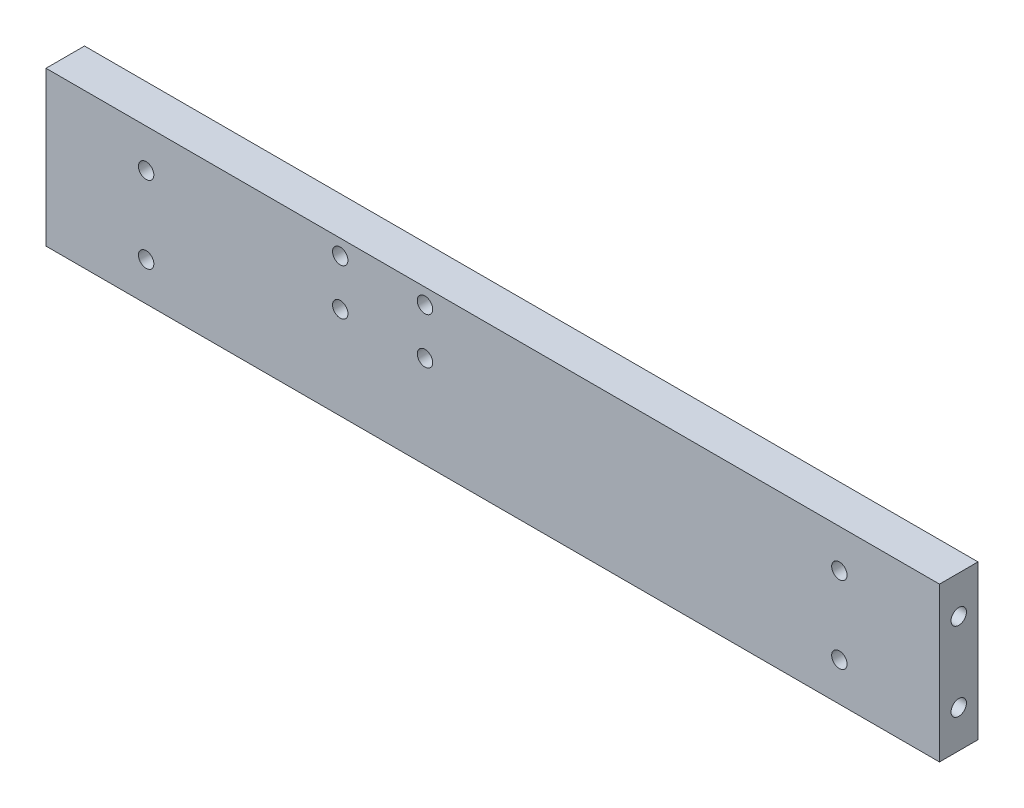
ISO-10303-21;
HEADER;
FILE_DESCRIPTION(('STEP AP214'),'2;1');
FILE_NAME('part.step','',(''),(''),'','','');
FILE_SCHEMA(('AUTOMOTIVE_DESIGN { 1 0 10303 214 1 1 1 1 }'));
ENDSEC;
DATA;
#1=APPLICATION_CONTEXT('core data for automotive mechanical design processes');
#2=APPLICATION_PROTOCOL_DEFINITION('international standard','automotive_design',2000,#1);
#3=PRODUCT_CONTEXT('',#1,'mechanical');
#4=PRODUCT('Part','Part','',(#3));
#5=PRODUCT_RELATED_PRODUCT_CATEGORY('part','',(#4));
#6=PRODUCT_DEFINITION_FORMATION('','',#4);
#7=PRODUCT_DEFINITION_CONTEXT('part definition',#1,'design');
#8=PRODUCT_DEFINITION('design','',#6,#7);
#9=PRODUCT_DEFINITION_SHAPE('','',#8);
#10=(LENGTH_UNIT() NAMED_UNIT(*) SI_UNIT(.MILLI.,.METRE.));
#11=(NAMED_UNIT(*) PLANE_ANGLE_UNIT() SI_UNIT($,.RADIAN.));
#12=(NAMED_UNIT(*) SI_UNIT($,.STERADIAN.) SOLID_ANGLE_UNIT());
#13=UNCERTAINTY_MEASURE_WITH_UNIT(LENGTH_MEASURE(1.E-05),#10,'distance_accuracy_value','');
#14=(GEOMETRIC_REPRESENTATION_CONTEXT(3) GLOBAL_UNCERTAINTY_ASSIGNED_CONTEXT((#13)) GLOBAL_UNIT_ASSIGNED_CONTEXT((#10,
#11,#12)) REPRESENTATION_CONTEXT('',''));
#15=CARTESIAN_POINT('',(0.,0.,0.));
#16=DIRECTION('',(0.,0.,1.));
#17=DIRECTION('',(1.,0.,0.));
#18=AXIS2_PLACEMENT_3D('',#15,#16,#17);
#19=CARTESIAN_POINT('',(0.,0.,5.));
#20=DIRECTION('',(0.,0.,1.));
#21=DIRECTION('',(1.,0.,0.));
#22=AXIS2_PLACEMENT_3D('',#19,#20,#21);
#23=PLANE('',#22);
#24=CARTESIAN_POINT('',(-19.8,2.,5.));
#25=DIRECTION('',(0.,0.,-1.));
#26=DIRECTION('',(-1.,0.,0.));
#27=AXIS2_PLACEMENT_3D('',#24,#25,#26);
#28=CIRCLE('',#27,1.);
#29=CARTESIAN_POINT('',(-20.8,2.,5.));
#30=VERTEX_POINT('',#29);
#31=EDGE_CURVE('E190',#30,#30,#28,.F.);
#32=ORIENTED_EDGE('',*,*,#31,.F.);
#33=EDGE_LOOP('',(#32));
#34=FACE_BOUND('',#33,.T.);
#35=CARTESIAN_POINT('',(-8.8,8.,5.));
#36=DIRECTION('',(0.,0.,-1.));
#37=DIRECTION('',(-1.,0.,0.));
#38=AXIS2_PLACEMENT_3D('',#35,#36,#37);
#39=CIRCLE('',#38,1.);
#40=CARTESIAN_POINT('',(-9.8,8.,5.));
#41=VERTEX_POINT('',#40);
#42=EDGE_CURVE('E161',#41,#41,#39,.F.);
#43=ORIENTED_EDGE('',*,*,#42,.F.);
#44=EDGE_LOOP('',(#43));
#45=FACE_BOUND('',#44,.T.);
#46=CARTESIAN_POINT('',(45.,-5.,5.));
#47=DIRECTION('',(0.,0.,1.));
#48=DIRECTION('',(1.,0.,0.));
#49=AXIS2_PLACEMENT_3D('',#46,#47,#48);
#50=CIRCLE('',#49,0.999999999999998);
#51=CARTESIAN_POINT('',(46.,-5.,5.));
#52=VERTEX_POINT('',#51);
#53=EDGE_CURVE('E170',#52,#52,#50,.T.);
#54=ORIENTED_EDGE('',*,*,#53,.F.);
#55=EDGE_LOOP('',(#54));
#56=FACE_BOUND('',#55,.T.);
#57=CARTESIAN_POINT('',(45.,5.,5.));
#58=DIRECTION('',(0.,0.,-1.));
#59=DIRECTION('',(-1.,0.,0.));
#60=AXIS2_PLACEMENT_3D('',#57,#58,#59);
#61=CIRCLE('',#60,0.999999999999998);
#62=CARTESIAN_POINT('',(44.,5.,5.));
#63=VERTEX_POINT('',#62);
#64=EDGE_CURVE('E149',#63,#63,#61,.T.);
#65=ORIENTED_EDGE('',*,*,#64,.T.);
#66=EDGE_LOOP('',(#65));
#67=FACE_BOUND('',#66,.T.);
#68=DIRECTION('',(0.,-1.,0.));
#69=VECTOR('',#68,1.);
#70=CARTESIAN_POINT('',(58.,0.,5.));
#71=LINE('',#70,#69);
#72=CARTESIAN_POINT('',(58.,10.,5.));
#73=VERTEX_POINT('',#72);
#74=CARTESIAN_POINT('',(58.,-10.,5.));
#75=VERTEX_POINT('',#74);
#76=EDGE_CURVE('E93',#73,#75,#71,.T.);
#77=ORIENTED_EDGE('',*,*,#76,.F.);
#78=DIRECTION('',(1.,0.,0.));
#79=VECTOR('',#78,1.);
#80=CARTESIAN_POINT('',(0.,10.,5.));
#81=LINE('',#80,#79);
#82=CARTESIAN_POINT('',(-58.,10.,5.));
#83=VERTEX_POINT('',#82);
#84=EDGE_CURVE('E84',#83,#73,#81,.T.);
#85=ORIENTED_EDGE('',*,*,#84,.F.);
#86=DIRECTION('',(0.,-1.,0.));
#87=VECTOR('',#86,1.);
#88=CARTESIAN_POINT('',(-58.,0.,5.));
#89=LINE('',#88,#87);
#90=CARTESIAN_POINT('',(-58.,-10.,5.));
#91=VERTEX_POINT('',#90);
#92=EDGE_CURVE('E88',#83,#91,#89,.T.);
#93=ORIENTED_EDGE('',*,*,#92,.T.);
#94=DIRECTION('',(1.,0.,0.));
#95=VECTOR('',#94,1.);
#96=CARTESIAN_POINT('',(0.,-10.,5.));
#97=LINE('',#96,#95);
#98=EDGE_CURVE('E51',#91,#75,#97,.T.);
#99=ORIENTED_EDGE('',*,*,#98,.T.);
#100=EDGE_LOOP('',(#77,#85,#93,#99));
#101=FACE_BOUND('',#100,.T.);
#102=CARTESIAN_POINT('',(-45.,-5.,5.));
#103=DIRECTION('',(0.,0.,-1.));
#104=DIRECTION('',(-1.,0.,0.));
#105=AXIS2_PLACEMENT_3D('',#102,#103,#104);
#106=CIRCLE('',#105,0.999999999999998);
#107=CARTESIAN_POINT('',(-46.,-5.,5.));
#108=VERTEX_POINT('',#107);
#109=EDGE_CURVE('E164',#108,#108,#106,.T.);
#110=ORIENTED_EDGE('',*,*,#109,.T.);
#111=EDGE_LOOP('',(#110));
#112=FACE_BOUND('',#111,.T.);
#113=CARTESIAN_POINT('',(-45.,5.,5.));
#114=DIRECTION('',(0.,0.,1.));
#115=DIRECTION('',(1.,0.,0.));
#116=AXIS2_PLACEMENT_3D('',#113,#114,#115);
#117=CIRCLE('',#116,0.999999999999998);
#118=CARTESIAN_POINT('',(-44.,5.,5.));
#119=VERTEX_POINT('',#118);
#120=EDGE_CURVE('E157',#119,#119,#117,.T.);
#121=ORIENTED_EDGE('',*,*,#120,.F.);
#122=EDGE_LOOP('',(#121));
#123=FACE_BOUND('',#122,.T.);
#124=CARTESIAN_POINT('',(-8.8,2.,5.));
#125=DIRECTION('',(0.,0.,-1.));
#126=DIRECTION('',(-1.,0.,0.));
#127=AXIS2_PLACEMENT_3D('',#124,#125,#126);
#128=CIRCLE('',#127,1.);
#129=CARTESIAN_POINT('',(-9.8,2.,5.));
#130=VERTEX_POINT('',#129);
#131=EDGE_CURVE('E178',#130,#130,#128,.T.);
#132=ORIENTED_EDGE('',*,*,#131,.T.);
#133=EDGE_LOOP('',(#132));
#134=FACE_BOUND('',#133,.T.);
#135=CARTESIAN_POINT('',(-19.8,8.,5.));
#136=DIRECTION('',(0.,0.,-1.));
#137=DIRECTION('',(-1.,0.,0.));
#138=AXIS2_PLACEMENT_3D('',#135,#136,#137);
#139=CIRCLE('',#138,1.);
#140=CARTESIAN_POINT('',(-20.8,8.,5.));
#141=VERTEX_POINT('',#140);
#142=EDGE_CURVE('E184',#141,#141,#139,.T.);
#143=ORIENTED_EDGE('',*,*,#142,.T.);
#144=EDGE_LOOP('',(#143));
#145=FACE_BOUND('',#144,.T.);
#146=ADVANCED_FACE('F34',(#34,#45,#56,#67,#101,#112,#123,#134,#145),#23,.T.);
#147=CARTESIAN_POINT('',(0.,0.,0.));
#148=DIRECTION('',(0.,0.,1.));
#149=DIRECTION('',(1.,0.,0.));
#150=AXIS2_PLACEMENT_3D('',#147,#148,#149);
#151=PLANE('',#150);
#152=CARTESIAN_POINT('',(-8.8,2.,0.));
#153=DIRECTION('',(0.,0.,-1.));
#154=DIRECTION('',(-1.,0.,0.));
#155=AXIS2_PLACEMENT_3D('',#152,#153,#154);
#156=CIRCLE('',#155,1.);
#157=CARTESIAN_POINT('',(-9.8,2.,0.));
#158=VERTEX_POINT('',#157);
#159=EDGE_CURVE('E193',#158,#158,#156,.T.);
#160=ORIENTED_EDGE('',*,*,#159,.F.);
#161=EDGE_LOOP('',(#160));
#162=FACE_BOUND('',#161,.T.);
#163=CARTESIAN_POINT('',(-8.8,8.,0.));
#164=DIRECTION('',(0.,0.,-1.));
#165=DIRECTION('',(-1.,0.,0.));
#166=AXIS2_PLACEMENT_3D('',#163,#164,#165);
#167=CIRCLE('',#166,1.);
#168=CARTESIAN_POINT('',(-9.8,8.,0.));
#169=VERTEX_POINT('',#168);
#170=EDGE_CURVE('E175',#169,#169,#167,.F.);
#171=ORIENTED_EDGE('',*,*,#170,.T.);
#172=EDGE_LOOP('',(#171));
#173=FACE_BOUND('',#172,.T.);
#174=CARTESIAN_POINT('',(-45.,-5.,0.));
#175=DIRECTION('',(0.,0.,-1.));
#176=DIRECTION('',(-1.,0.,0.));
#177=AXIS2_PLACEMENT_3D('',#174,#175,#176);
#178=CIRCLE('',#177,0.999999999999998);
#179=CARTESIAN_POINT('',(-46.,-5.,0.));
#180=VERTEX_POINT('',#179);
#181=EDGE_CURVE('E167',#180,#180,#178,.T.);
#182=ORIENTED_EDGE('',*,*,#181,.F.);
#183=EDGE_LOOP('',(#182));
#184=FACE_BOUND('',#183,.T.);
#185=CARTESIAN_POINT('',(45.,5.,0.));
#186=DIRECTION('',(0.,0.,-1.));
#187=DIRECTION('',(-1.,0.,0.));
#188=AXIS2_PLACEMENT_3D('',#185,#186,#187);
#189=CIRCLE('',#188,0.999999999999998);
#190=CARTESIAN_POINT('',(44.,5.,0.));
#191=VERTEX_POINT('',#190);
#192=EDGE_CURVE('E143',#191,#191,#189,.T.);
#193=ORIENTED_EDGE('',*,*,#192,.F.);
#194=EDGE_LOOP('',(#193));
#195=FACE_BOUND('',#194,.T.);
#196=DIRECTION('',(0.,-1.,0.));
#197=VECTOR('',#196,1.);
#198=CARTESIAN_POINT('',(58.,0.,0.));
#199=LINE('',#198,#197);
#200=CARTESIAN_POINT('',(58.,10.,0.));
#201=VERTEX_POINT('',#200);
#202=CARTESIAN_POINT('',(58.,-10.,0.));
#203=VERTEX_POINT('',#202);
#204=EDGE_CURVE('E100',#201,#203,#199,.T.);
#205=ORIENTED_EDGE('',*,*,#204,.T.);
#206=DIRECTION('',(1.,0.,0.));
#207=VECTOR('',#206,1.);
#208=CARTESIAN_POINT('',(0.,-10.,0.));
#209=LINE('',#208,#207);
#210=CARTESIAN_POINT('',(-58.,-10.,0.));
#211=VERTEX_POINT('',#210);
#212=EDGE_CURVE('E95',#211,#203,#209,.T.);
#213=ORIENTED_EDGE('',*,*,#212,.F.);
#214=DIRECTION('',(0.,-1.,0.));
#215=VECTOR('',#214,1.);
#216=CARTESIAN_POINT('',(-58.,0.,0.));
#217=LINE('',#216,#215);
#218=CARTESIAN_POINT('',(-58.,10.,0.));
#219=VERTEX_POINT('',#218);
#220=EDGE_CURVE('E66',#219,#211,#217,.T.);
#221=ORIENTED_EDGE('',*,*,#220,.F.);
#222=DIRECTION('',(1.,0.,0.));
#223=VECTOR('',#222,1.);
#224=CARTESIAN_POINT('',(0.,10.,0.));
#225=LINE('',#224,#223);
#226=EDGE_CURVE('E86',#219,#201,#225,.T.);
#227=ORIENTED_EDGE('',*,*,#226,.T.);
#228=EDGE_LOOP('',(#205,#213,#221,#227));
#229=FACE_BOUND('',#228,.T.);
#230=CARTESIAN_POINT('',(45.,-5.,0.));
#231=DIRECTION('',(0.,0.,1.));
#232=DIRECTION('',(1.,0.,0.));
#233=AXIS2_PLACEMENT_3D('',#230,#231,#232);
#234=CIRCLE('',#233,0.999999999999998);
#235=CARTESIAN_POINT('',(46.,-5.,0.));
#236=VERTEX_POINT('',#235);
#237=EDGE_CURVE('E155',#236,#236,#234,.T.);
#238=ORIENTED_EDGE('',*,*,#237,.T.);
#239=EDGE_LOOP('',(#238));
#240=FACE_BOUND('',#239,.T.);
#241=CARTESIAN_POINT('',(-45.,5.,0.));
#242=DIRECTION('',(0.,0.,1.));
#243=DIRECTION('',(1.,0.,0.));
#244=AXIS2_PLACEMENT_3D('',#241,#242,#243);
#245=CIRCLE('',#244,0.999999999999998);
#246=CARTESIAN_POINT('',(-44.,5.,0.));
#247=VERTEX_POINT('',#246);
#248=EDGE_CURVE('E160',#247,#247,#245,.T.);
#249=ORIENTED_EDGE('',*,*,#248,.T.);
#250=EDGE_LOOP('',(#249));
#251=FACE_BOUND('',#250,.T.);
#252=CARTESIAN_POINT('',(-19.8,2.,0.));
#253=DIRECTION('',(0.,0.,-1.));
#254=DIRECTION('',(-1.,0.,0.));
#255=AXIS2_PLACEMENT_3D('',#252,#253,#254);
#256=CIRCLE('',#255,1.);
#257=CARTESIAN_POINT('',(-20.8,2.,0.));
#258=VERTEX_POINT('',#257);
#259=EDGE_CURVE('E187',#258,#258,#256,.F.);
#260=ORIENTED_EDGE('',*,*,#259,.T.);
#261=EDGE_LOOP('',(#260));
#262=FACE_BOUND('',#261,.T.);
#263=CARTESIAN_POINT('',(-19.8,8.,0.));
#264=DIRECTION('',(0.,0.,-1.));
#265=DIRECTION('',(-1.,0.,0.));
#266=AXIS2_PLACEMENT_3D('',#263,#264,#265);
#267=CIRCLE('',#266,1.);
#268=CARTESIAN_POINT('',(-20.8,8.,0.));
#269=VERTEX_POINT('',#268);
#270=EDGE_CURVE('E181',#269,#269,#267,.T.);
#271=ORIENTED_EDGE('',*,*,#270,.F.);
#272=EDGE_LOOP('',(#271));
#273=FACE_BOUND('',#272,.T.);
#274=ADVANCED_FACE('F112',(#162,#173,#184,#195,#229,#240,#251,#262,#273),#151,.F.);
#275=CARTESIAN_POINT('',(-58.,0.,5.));
#276=DIRECTION('',(1.,0.,0.));
#277=DIRECTION('',(0.,0.,-1.));
#278=AXIS2_PLACEMENT_3D('',#275,#276,#277);
#279=PLANE('',#278);
#280=ORIENTED_EDGE('',*,*,#220,.T.);
#281=DIRECTION('',(0.,0.,-1.));
#282=VECTOR('',#281,1.);
#283=CARTESIAN_POINT('',(-58.,-10.,5.));
#284=LINE('',#283,#282);
#285=EDGE_CURVE('E87',#91,#211,#284,.T.);
#286=ORIENTED_EDGE('',*,*,#285,.F.);
#287=ORIENTED_EDGE('',*,*,#92,.F.);
#288=DIRECTION('',(0.,0.,-1.));
#289=VECTOR('',#288,1.);
#290=CARTESIAN_POINT('',(-58.,10.,5.));
#291=LINE('',#290,#289);
#292=EDGE_CURVE('E43',#83,#219,#291,.T.);
#293=ORIENTED_EDGE('',*,*,#292,.T.);
#294=EDGE_LOOP('',(#280,#286,#287,#293));
#295=FACE_BOUND('',#294,.T.);
#296=CARTESIAN_POINT('',(-58.,-5.,2.5));
#297=DIRECTION('',(-1.,0.,0.));
#298=DIRECTION('',(0.,0.,1.));
#299=AXIS2_PLACEMENT_3D('',#296,#297,#298);
#300=CIRCLE('',#299,1.);
#301=CARTESIAN_POINT('',(-58.,-5.,3.5));
#302=VERTEX_POINT('',#301);
#303=EDGE_CURVE('E147',#302,#302,#300,.F.);
#304=ORIENTED_EDGE('',*,*,#303,.T.);
#305=EDGE_LOOP('',(#304));
#306=FACE_BOUND('',#305,.T.);
#307=CARTESIAN_POINT('',(-58.,5.,2.5));
#308=DIRECTION('',(-1.,0.,0.));
#309=DIRECTION('',(0.,0.,1.));
#310=AXIS2_PLACEMENT_3D('',#307,#308,#309);
#311=CIRCLE('',#310,1.);
#312=CARTESIAN_POINT('',(-58.,5.,3.5));
#313=VERTEX_POINT('',#312);
#314=EDGE_CURVE('E135',#313,#313,#311,.T.);
#315=ORIENTED_EDGE('',*,*,#314,.F.);
#316=EDGE_LOOP('',(#315));
#317=FACE_BOUND('',#316,.T.);
#318=ADVANCED_FACE('F89',(#295,#306,#317),#279,.F.);
#319=CARTESIAN_POINT('',(58.,0.,5.));
#320=DIRECTION('',(1.,0.,0.));
#321=DIRECTION('',(0.,1.,0.));
#322=AXIS2_PLACEMENT_3D('',#319,#320,#321);
#323=PLANE('',#322);
#324=ORIENTED_EDGE('',*,*,#204,.F.);
#325=DIRECTION('',(0.,0.,-1.));
#326=VECTOR('',#325,1.);
#327=CARTESIAN_POINT('',(58.,10.,5.));
#328=LINE('',#327,#326);
#329=EDGE_CURVE('E11',#73,#201,#328,.T.);
#330=ORIENTED_EDGE('',*,*,#329,.F.);
#331=ORIENTED_EDGE('',*,*,#76,.T.);
#332=DIRECTION('',(0.,0.,-1.));
#333=VECTOR('',#332,1.);
#334=CARTESIAN_POINT('',(58.,-10.,5.));
#335=LINE('',#334,#333);
#336=EDGE_CURVE('E73',#75,#203,#335,.T.);
#337=ORIENTED_EDGE('',*,*,#336,.T.);
#338=EDGE_LOOP('',(#324,#330,#331,#337));
#339=FACE_BOUND('',#338,.T.);
#340=CARTESIAN_POINT('',(58.,5.11999999999998,2.5));
#341=DIRECTION('',(1.,0.,0.));
#342=DIRECTION('',(0.,0.,-1.));
#343=AXIS2_PLACEMENT_3D('',#340,#341,#342);
#344=CIRCLE('',#343,1.);
#345=CARTESIAN_POINT('',(58.,5.11999999999998,1.5));
#346=VERTEX_POINT('',#345);
#347=EDGE_CURVE('E119',#346,#346,#344,.T.);
#348=ORIENTED_EDGE('',*,*,#347,.F.);
#349=EDGE_LOOP('',(#348));
#350=FACE_BOUND('',#349,.T.);
#351=CARTESIAN_POINT('',(58.,-5.12000000000002,2.5));
#352=DIRECTION('',(1.,0.,0.));
#353=DIRECTION('',(0.,0.,-1.));
#354=AXIS2_PLACEMENT_3D('',#351,#352,#353);
#355=CIRCLE('',#354,1.);
#356=CARTESIAN_POINT('',(58.,-5.12000000000002,1.5));
#357=VERTEX_POINT('',#356);
#358=EDGE_CURVE('E122',#357,#357,#355,.F.);
#359=ORIENTED_EDGE('',*,*,#358,.T.);
#360=EDGE_LOOP('',(#359));
#361=FACE_BOUND('',#360,.T.);
#362=ADVANCED_FACE('F36',(#339,#350,#361),#323,.T.);
#363=CARTESIAN_POINT('',(0.,10.,5.));
#364=DIRECTION('',(0.,1.,0.));
#365=DIRECTION('',(0.,0.,1.));
#366=AXIS2_PLACEMENT_3D('',#363,#364,#365);
#367=PLANE('',#366);
#368=ORIENTED_EDGE('',*,*,#226,.F.);
#369=ORIENTED_EDGE('',*,*,#292,.F.);
#370=ORIENTED_EDGE('',*,*,#84,.T.);
#371=ORIENTED_EDGE('',*,*,#329,.T.);
#372=EDGE_LOOP('',(#368,#369,#370,#371));
#373=FACE_BOUND('',#372,.T.);
#374=ADVANCED_FACE('F82',(#373),#367,.T.);
#375=CARTESIAN_POINT('',(0.,-10.,5.));
#376=DIRECTION('',(0.,1.,0.));
#377=DIRECTION('',(0.,0.,1.));
#378=AXIS2_PLACEMENT_3D('',#375,#376,#377);
#379=PLANE('',#378);
#380=ORIENTED_EDGE('',*,*,#212,.T.);
#381=ORIENTED_EDGE('',*,*,#336,.F.);
#382=ORIENTED_EDGE('',*,*,#98,.F.);
#383=ORIENTED_EDGE('',*,*,#285,.T.);
#384=EDGE_LOOP('',(#380,#381,#382,#383));
#385=FACE_BOUND('',#384,.T.);
#386=ADVANCED_FACE('F110',(#385),#379,.F.);
#387=CARTESIAN_POINT('',(48.,5.11999999999998,2.5));
#388=DIRECTION('',(1.,0.,0.));
#389=DIRECTION('',(0.,0.,-1.));
#390=AXIS2_PLACEMENT_3D('',#387,#388,#389);
#391=CYLINDRICAL_SURFACE('',#390,1.);
#392=CARTESIAN_POINT('',(48.,5.11999999999998,2.5));
#393=DIRECTION('',(1.,0.,0.));
#394=DIRECTION('',(0.,0.,-1.));
#395=AXIS2_PLACEMENT_3D('',#392,#393,#394);
#396=CIRCLE('',#395,1.);
#397=CARTESIAN_POINT('',(48.,5.11999999999998,1.5));
#398=VERTEX_POINT('',#397);
#399=EDGE_CURVE('E127',#398,#398,#396,.T.);
#400=ORIENTED_EDGE('',*,*,#399,.F.);
#401=EDGE_LOOP('',(#400));
#402=FACE_BOUND('',#401,.T.);
#403=ORIENTED_EDGE('',*,*,#347,.T.);
#404=EDGE_LOOP('',(#403));
#405=FACE_BOUND('',#404,.T.);
#406=ADVANCED_FACE('F247',(#402,#405),#391,.F.);
#407=CARTESIAN_POINT('',(48.,5.11999999999998,2.5));
#408=DIRECTION('',(1.,0.,0.));
#409=DIRECTION('',(0.,0.,-1.));
#410=AXIS2_PLACEMENT_3D('',#407,#408,#409);
#411=PLANE('',#410);
#412=ORIENTED_EDGE('',*,*,#399,.T.);
#413=EDGE_LOOP('',(#412));
#414=FACE_BOUND('',#413,.T.);
#415=ADVANCED_FACE('F242',(#414),#411,.T.);
#416=CARTESIAN_POINT('',(48.,-5.12000000000002,2.5));
#417=DIRECTION('',(1.,0.,0.));
#418=DIRECTION('',(0.,0.,-1.));
#419=AXIS2_PLACEMENT_3D('',#416,#417,#418);
#420=CYLINDRICAL_SURFACE('',#419,1.);
#421=CARTESIAN_POINT('',(48.,-5.12000000000002,2.5));
#422=DIRECTION('',(1.,0.,0.));
#423=DIRECTION('',(0.,0.,-1.));
#424=AXIS2_PLACEMENT_3D('',#421,#422,#423);
#425=CIRCLE('',#424,1.);
#426=CARTESIAN_POINT('',(48.,-5.12000000000002,1.5));
#427=VERTEX_POINT('',#426);
#428=EDGE_CURVE('E103',#427,#427,#425,.F.);
#429=ORIENTED_EDGE('',*,*,#428,.T.);
#430=EDGE_LOOP('',(#429));
#431=FACE_BOUND('',#430,.T.);
#432=ORIENTED_EDGE('',*,*,#358,.F.);
#433=EDGE_LOOP('',(#432));
#434=FACE_BOUND('',#433,.T.);
#435=ADVANCED_FACE('F270',(#431,#434),#420,.F.);
#436=CARTESIAN_POINT('',(48.,0.,0.));
#437=DIRECTION('',(1.,0.,0.));
#438=DIRECTION('',(0.,0.,-1.));
#439=AXIS2_PLACEMENT_3D('',#436,#437,#438);
#440=PLANE('',#439);
#441=ORIENTED_EDGE('',*,*,#428,.F.);
#442=EDGE_LOOP('',(#441));
#443=FACE_BOUND('',#442,.T.);
#444=ADVANCED_FACE('F276',(#443),#440,.T.);
#445=CARTESIAN_POINT('',(-53.,-5.,2.5));
#446=DIRECTION('',(-1.,0.,0.));
#447=DIRECTION('',(0.,-1.,0.));
#448=AXIS2_PLACEMENT_3D('',#445,#446,#447);
#449=CYLINDRICAL_SURFACE('',#448,1.);
#450=CARTESIAN_POINT('',(-53.,-5.,2.5));
#451=DIRECTION('',(-1.,0.,0.));
#452=DIRECTION('',(0.,0.,1.));
#453=AXIS2_PLACEMENT_3D('',#450,#451,#452);
#454=CIRCLE('',#453,1.);
#455=CARTESIAN_POINT('',(-53.,-5.,3.5));
#456=VERTEX_POINT('',#455);
#457=EDGE_CURVE('E140',#456,#456,#454,.F.);
#458=ORIENTED_EDGE('',*,*,#457,.T.);
#459=EDGE_LOOP('',(#458));
#460=FACE_BOUND('',#459,.T.);
#461=ORIENTED_EDGE('',*,*,#303,.F.);
#462=EDGE_LOOP('',(#461));
#463=FACE_BOUND('',#462,.T.);
#464=ADVANCED_FACE('F284',(#460,#463),#449,.F.);
#465=CARTESIAN_POINT('',(-53.,0.,0.));
#466=DIRECTION('',(-1.,0.,0.));
#467=DIRECTION('',(0.,0.,1.));
#468=AXIS2_PLACEMENT_3D('',#465,#466,#467);
#469=PLANE('',#468);
#470=ORIENTED_EDGE('',*,*,#457,.F.);
#471=EDGE_LOOP('',(#470));
#472=FACE_BOUND('',#471,.T.);
#473=ADVANCED_FACE('F293',(#472),#469,.T.);
#474=CARTESIAN_POINT('',(-53.,5.,2.5));
#475=DIRECTION('',(-1.,0.,0.));
#476=DIRECTION('',(0.,-1.,0.));
#477=AXIS2_PLACEMENT_3D('',#474,#475,#476);
#478=CYLINDRICAL_SURFACE('',#477,1.);
#479=CARTESIAN_POINT('',(-53.,5.,2.5));
#480=DIRECTION('',(-1.,0.,0.));
#481=DIRECTION('',(0.,0.,1.));
#482=AXIS2_PLACEMENT_3D('',#479,#480,#481);
#483=CIRCLE('',#482,1.);
#484=CARTESIAN_POINT('',(-53.,5.,3.5));
#485=VERTEX_POINT('',#484);
#486=EDGE_CURVE('E131',#485,#485,#483,.T.);
#487=ORIENTED_EDGE('',*,*,#486,.F.);
#488=EDGE_LOOP('',(#487));
#489=FACE_BOUND('',#488,.T.);
#490=ORIENTED_EDGE('',*,*,#314,.T.);
#491=EDGE_LOOP('',(#490));
#492=FACE_BOUND('',#491,.T.);
#493=ADVANCED_FACE('F231',(#489,#492),#478,.F.);
#494=CARTESIAN_POINT('',(-53.,0.,0.));
#495=DIRECTION('',(-1.,0.,0.));
#496=DIRECTION('',(0.,0.,1.));
#497=AXIS2_PLACEMENT_3D('',#494,#495,#496);
#498=PLANE('',#497);
#499=ORIENTED_EDGE('',*,*,#486,.T.);
#500=EDGE_LOOP('',(#499));
#501=FACE_BOUND('',#500,.T.);
#502=ADVANCED_FACE('F221',(#501),#498,.T.);
#503=CARTESIAN_POINT('',(45.,5.,5.));
#504=DIRECTION('',(0.,0.,-1.));
#505=DIRECTION('',(-1.,0.,0.));
#506=AXIS2_PLACEMENT_3D('',#503,#504,#505);
#507=CYLINDRICAL_SURFACE('',#506,0.999999999999998);
#508=ORIENTED_EDGE('',*,*,#64,.F.);
#509=EDGE_LOOP('',(#508));
#510=FACE_BOUND('',#509,.T.);
#511=ORIENTED_EDGE('',*,*,#192,.T.);
#512=EDGE_LOOP('',(#511));
#513=FACE_BOUND('',#512,.T.);
#514=ADVANCED_FACE('F218',(#510,#513),#507,.F.);
#515=CARTESIAN_POINT('',(45.,-5.,5.));
#516=DIRECTION('',(0.,0.,-1.));
#517=DIRECTION('',(-1.,0.,0.));
#518=AXIS2_PLACEMENT_3D('',#515,#516,#517);
#519=CYLINDRICAL_SURFACE('',#518,0.999999999999998);
#520=ORIENTED_EDGE('',*,*,#53,.T.);
#521=EDGE_LOOP('',(#520));
#522=FACE_BOUND('',#521,.T.);
#523=ORIENTED_EDGE('',*,*,#237,.F.);
#524=EDGE_LOOP('',(#523));
#525=FACE_BOUND('',#524,.T.);
#526=ADVANCED_FACE('F220',(#522,#525),#519,.F.);
#527=CARTESIAN_POINT('',(-45.,-5.,5.));
#528=DIRECTION('',(0.,0.,-1.));
#529=DIRECTION('',(-1.,0.,0.));
#530=AXIS2_PLACEMENT_3D('',#527,#528,#529);
#531=CYLINDRICAL_SURFACE('',#530,0.999999999999998);
#532=ORIENTED_EDGE('',*,*,#109,.F.);
#533=EDGE_LOOP('',(#532));
#534=FACE_BOUND('',#533,.T.);
#535=ORIENTED_EDGE('',*,*,#181,.T.);
#536=EDGE_LOOP('',(#535));
#537=FACE_BOUND('',#536,.T.);
#538=ADVANCED_FACE('F228',(#534,#537),#531,.F.);
#539=CARTESIAN_POINT('',(-45.,5.,5.));
#540=DIRECTION('',(0.,0.,-1.));
#541=DIRECTION('',(-1.,0.,0.));
#542=AXIS2_PLACEMENT_3D('',#539,#540,#541);
#543=CYLINDRICAL_SURFACE('',#542,0.999999999999998);
#544=ORIENTED_EDGE('',*,*,#120,.T.);
#545=EDGE_LOOP('',(#544));
#546=FACE_BOUND('',#545,.T.);
#547=ORIENTED_EDGE('',*,*,#248,.F.);
#548=EDGE_LOOP('',(#547));
#549=FACE_BOUND('',#548,.T.);
#550=ADVANCED_FACE('F332',(#546,#549),#543,.F.);
#551=CARTESIAN_POINT('',(-8.8,8.,5.));
#552=DIRECTION('',(0.,0.,-1.));
#553=DIRECTION('',(-1.,0.,0.));
#554=AXIS2_PLACEMENT_3D('',#551,#552,#553);
#555=CYLINDRICAL_SURFACE('',#554,1.);
#556=ORIENTED_EDGE('',*,*,#42,.T.);
#557=EDGE_LOOP('',(#556));
#558=FACE_BOUND('',#557,.T.);
#559=ORIENTED_EDGE('',*,*,#170,.F.);
#560=EDGE_LOOP('',(#559));
#561=FACE_BOUND('',#560,.T.);
#562=ADVANCED_FACE('F205',(#558,#561),#555,.F.);
#563=CARTESIAN_POINT('',(-8.8,2.,5.));
#564=DIRECTION('',(0.,0.,-1.));
#565=DIRECTION('',(-1.,0.,0.));
#566=AXIS2_PLACEMENT_3D('',#563,#564,#565);
#567=CYLINDRICAL_SURFACE('',#566,1.);
#568=ORIENTED_EDGE('',*,*,#131,.F.);
#569=EDGE_LOOP('',(#568));
#570=FACE_BOUND('',#569,.T.);
#571=ORIENTED_EDGE('',*,*,#159,.T.);
#572=EDGE_LOOP('',(#571));
#573=FACE_BOUND('',#572,.T.);
#574=ADVANCED_FACE('F201',(#570,#573),#567,.F.);
#575=CARTESIAN_POINT('',(-19.8,2.,5.));
#576=DIRECTION('',(0.,0.,-1.));
#577=DIRECTION('',(-1.,0.,0.));
#578=AXIS2_PLACEMENT_3D('',#575,#576,#577);
#579=CYLINDRICAL_SURFACE('',#578,1.);
#580=ORIENTED_EDGE('',*,*,#31,.T.);
#581=EDGE_LOOP('',(#580));
#582=FACE_BOUND('',#581,.T.);
#583=ORIENTED_EDGE('',*,*,#259,.F.);
#584=EDGE_LOOP('',(#583));
#585=FACE_BOUND('',#584,.T.);
#586=ADVANCED_FACE('F204',(#582,#585),#579,.F.);
#587=CARTESIAN_POINT('',(-19.8,8.,5.));
#588=DIRECTION('',(0.,0.,-1.));
#589=DIRECTION('',(-1.,0.,0.));
#590=AXIS2_PLACEMENT_3D('',#587,#588,#589);
#591=CYLINDRICAL_SURFACE('',#590,1.);
#592=ORIENTED_EDGE('',*,*,#142,.F.);
#593=EDGE_LOOP('',(#592));
#594=FACE_BOUND('',#593,.T.);
#595=ORIENTED_EDGE('',*,*,#270,.T.);
#596=EDGE_LOOP('',(#595));
#597=FACE_BOUND('',#596,.T.);
#598=ADVANCED_FACE('F375',(#594,#597),#591,.F.);
#599=CLOSED_SHELL('',(#146,#274,#318,#362,#374,#386,#406,#415,#435,#444,#464,#473,#493,#502,
#514,#526,#538,#550,#562,#574,#586,#598));
#600=MANIFOLD_SOLID_BREP('B2',#599);
#601=ADVANCED_BREP_SHAPE_REPRESENTATION('',(#18,#600),#14);
#602=SHAPE_DEFINITION_REPRESENTATION(#9,#601);
ENDSEC;
END-ISO-10303-21;
